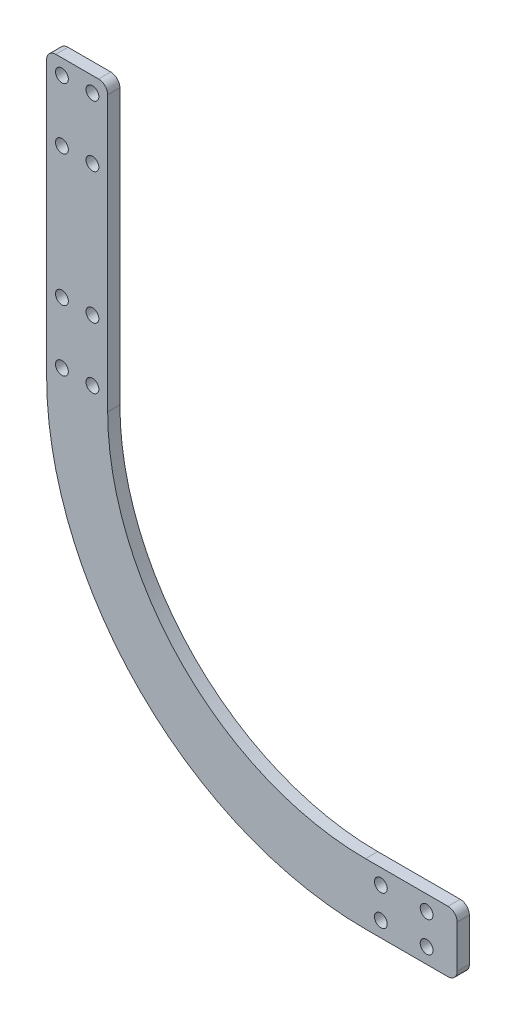
ISO-10303-21;
HEADER;
FILE_DESCRIPTION(('STEP AP214'),'2;1');
FILE_NAME('part.step','',(''),(''),'','','');
FILE_SCHEMA(('AUTOMOTIVE_DESIGN { 1 0 10303 214 1 1 1 1 }'));
ENDSEC;
DATA;
#1=APPLICATION_CONTEXT('core data for automotive mechanical design processes');
#2=APPLICATION_PROTOCOL_DEFINITION('international standard','automotive_design',2000,#1);
#3=PRODUCT_CONTEXT('',#1,'mechanical');
#4=PRODUCT('Part','Part','',(#3));
#5=PRODUCT_RELATED_PRODUCT_CATEGORY('part','',(#4));
#6=PRODUCT_DEFINITION_FORMATION('','',#4);
#7=PRODUCT_DEFINITION_CONTEXT('part definition',#1,'design');
#8=PRODUCT_DEFINITION('design','',#6,#7);
#9=PRODUCT_DEFINITION_SHAPE('','',#8);
#10=(LENGTH_UNIT() NAMED_UNIT(*) SI_UNIT(.MILLI.,.METRE.));
#11=(NAMED_UNIT(*) PLANE_ANGLE_UNIT() SI_UNIT($,.RADIAN.));
#12=(NAMED_UNIT(*) SI_UNIT($,.STERADIAN.) SOLID_ANGLE_UNIT());
#13=UNCERTAINTY_MEASURE_WITH_UNIT(LENGTH_MEASURE(1.E-05),#10,'distance_accuracy_value','');
#14=(GEOMETRIC_REPRESENTATION_CONTEXT(3) GLOBAL_UNCERTAINTY_ASSIGNED_CONTEXT((#13)) GLOBAL_UNIT_ASSIGNED_CONTEXT((#10,
#11,#12)) REPRESENTATION_CONTEXT('',''));
#15=CARTESIAN_POINT('',(0.,0.,0.));
#16=DIRECTION('',(0.,0.,1.));
#17=DIRECTION('',(1.,0.,0.));
#18=AXIS2_PLACEMENT_3D('',#15,#16,#17);
#19=CARTESIAN_POINT('',(0.,84.5,4.));
#20=DIRECTION('',(0.,0.,-1.));
#21=DIRECTION('',(-1.,0.,0.));
#22=AXIS2_PLACEMENT_3D('',#19,#20,#21);
#23=CYLINDRICAL_SURFACE('',#22,84.5);
#24=CARTESIAN_POINT('',(0.,84.5,0.));
#25=DIRECTION('',(0.,0.,-1.));
#26=DIRECTION('',(1.,0.,0.));
#27=AXIS2_PLACEMENT_3D('',#24,#25,#26);
#28=CIRCLE('',#27,84.5);
#29=CARTESIAN_POINT('',(0.,0.,0.));
#30=VERTEX_POINT('',#29);
#31=CARTESIAN_POINT('',(-84.5,84.5,0.));
#32=VERTEX_POINT('',#31);
#33=EDGE_CURVE('E144',#30,#32,#28,.T.);
#34=ORIENTED_EDGE('',*,*,#33,.T.);
#35=DIRECTION('',(0.,0.,-1.));
#36=VECTOR('',#35,1.);
#37=CARTESIAN_POINT('',(-84.5,84.5,4.));
#38=LINE('',#37,#36);
#39=CARTESIAN_POINT('',(-84.5,84.5,4.));
#40=VERTEX_POINT('',#39);
#41=EDGE_CURVE('E151',#40,#32,#38,.T.);
#42=ORIENTED_EDGE('',*,*,#41,.F.);
#43=CARTESIAN_POINT('',(0.,84.5,4.));
#44=DIRECTION('',(0.,0.,-1.));
#45=DIRECTION('',(1.,0.,0.));
#46=AXIS2_PLACEMENT_3D('',#43,#44,#45);
#47=CIRCLE('',#46,84.5);
#48=CARTESIAN_POINT('',(0.,0.,4.));
#49=VERTEX_POINT('',#48);
#50=EDGE_CURVE('E143',#49,#40,#47,.T.);
#51=ORIENTED_EDGE('',*,*,#50,.F.);
#52=DIRECTION('',(0.,0.,-1.));
#53=VECTOR('',#52,1.);
#54=CARTESIAN_POINT('',(0.,0.,4.));
#55=LINE('',#54,#53);
#56=EDGE_CURVE('E149',#49,#30,#55,.T.);
#57=ORIENTED_EDGE('',*,*,#56,.T.);
#58=EDGE_LOOP('',(#34,#42,#51,#57));
#59=FACE_BOUND('',#58,.T.);
#60=ADVANCED_FACE('F34',(#59),#23,.F.);
#61=CARTESIAN_POINT('',(0.,84.5,4.));
#62=DIRECTION('',(0.,0.,-1.));
#63=DIRECTION('',(-1.,0.,0.));
#64=AXIS2_PLACEMENT_3D('',#61,#62,#63);
#65=CYLINDRICAL_SURFACE('',#64,104.5);
#66=CARTESIAN_POINT('',(0.,84.5,0.));
#67=DIRECTION('',(0.,0.,1.));
#68=DIRECTION('',(-1.,0.,0.));
#69=AXIS2_PLACEMENT_3D('',#66,#67,#68);
#70=CIRCLE('',#69,104.5);
#71=CARTESIAN_POINT('',(-104.5,84.5,0.));
#72=VERTEX_POINT('',#71);
#73=CARTESIAN_POINT('',(0.,-20.,0.));
#74=VERTEX_POINT('',#73);
#75=EDGE_CURVE('E128',#72,#74,#70,.T.);
#76=ORIENTED_EDGE('',*,*,#75,.T.);
#77=DIRECTION('',(0.,0.,-1.));
#78=VECTOR('',#77,1.);
#79=CARTESIAN_POINT('',(0.,-20.,4.));
#80=LINE('',#79,#78);
#81=CARTESIAN_POINT('',(0.,-20.,4.));
#82=VERTEX_POINT('',#81);
#83=EDGE_CURVE('E139',#82,#74,#80,.T.);
#84=ORIENTED_EDGE('',*,*,#83,.F.);
#85=CARTESIAN_POINT('',(0.,84.5,4.));
#86=DIRECTION('',(0.,0.,1.));
#87=DIRECTION('',(-1.,0.,0.));
#88=AXIS2_PLACEMENT_3D('',#85,#86,#87);
#89=CIRCLE('',#88,104.5);
#90=CARTESIAN_POINT('',(-104.5,84.5,4.));
#91=VERTEX_POINT('',#90);
#92=EDGE_CURVE('E153',#91,#82,#89,.T.);
#93=ORIENTED_EDGE('',*,*,#92,.F.);
#94=DIRECTION('',(0.,0.,-1.));
#95=VECTOR('',#94,1.);
#96=CARTESIAN_POINT('',(-104.5,84.5,4.));
#97=LINE('',#96,#95);
#98=EDGE_CURVE('E142',#91,#72,#97,.T.);
#99=ORIENTED_EDGE('',*,*,#98,.T.);
#100=EDGE_LOOP('',(#76,#84,#93,#99));
#101=FACE_BOUND('',#100,.T.);
#102=ADVANCED_FACE('F137',(#101),#65,.T.);
#103=CARTESIAN_POINT('',(0.,84.5,4.));
#104=DIRECTION('',(0.,0.,1.));
#105=DIRECTION('',(1.,0.,0.));
#106=AXIS2_PLACEMENT_3D('',#103,#104,#105);
#107=PLANE('',#106);
#108=CARTESIAN_POINT('',(19.9999999999973,-5.00000000000145,4.));
#109=DIRECTION('',(0.,0.,1.));
#110=DIRECTION('',(1.,0.,0.));
#111=AXIS2_PLACEMENT_3D('',#108,#109,#110);
#112=CIRCLE('',#111,2.09999999999999);
#113=CARTESIAN_POINT('',(22.0999999999973,-5.00000000000145,4.));
#114=VERTEX_POINT('',#113);
#115=EDGE_CURVE('E279',#114,#114,#112,.T.);
#116=ORIENTED_EDGE('',*,*,#115,.F.);
#117=EDGE_LOOP('',(#116));
#118=FACE_BOUND('',#117,.T.);
#119=CARTESIAN_POINT('',(4.99999999999726,-5.00000000000151,4.));
#120=DIRECTION('',(0.,0.,1.));
#121=DIRECTION('',(1.,0.,0.));
#122=AXIS2_PLACEMENT_3D('',#119,#120,#121);
#123=CIRCLE('',#122,2.09999999999999);
#124=CARTESIAN_POINT('',(7.09999999999725,-5.00000000000151,4.));
#125=VERTEX_POINT('',#124);
#126=EDGE_CURVE('E272',#125,#125,#123,.T.);
#127=ORIENTED_EDGE('',*,*,#126,.F.);
#128=EDGE_LOOP('',(#127));
#129=FACE_BOUND('',#128,.T.);
#130=CARTESIAN_POINT('',(4.99999999999726,-14.9999999999985,4.));
#131=DIRECTION('',(0.,0.,1.));
#132=DIRECTION('',(1.,0.,0.));
#133=AXIS2_PLACEMENT_3D('',#130,#131,#132);
#134=CIRCLE('',#133,2.09999999999999);
#135=CARTESIAN_POINT('',(7.09999999999725,-14.9999999999985,4.));
#136=VERTEX_POINT('',#135);
#137=EDGE_CURVE('E291',#136,#136,#134,.T.);
#138=ORIENTED_EDGE('',*,*,#137,.F.);
#139=EDGE_LOOP('',(#138));
#140=FACE_BOUND('',#139,.T.);
#141=CARTESIAN_POINT('',(-99.5,109.499999999997,4.));
#142=DIRECTION('',(0.,0.,1.));
#143=DIRECTION('',(1.,0.,0.));
#144=AXIS2_PLACEMENT_3D('',#141,#142,#143);
#145=CIRCLE('',#144,2.09999999999999);
#146=CARTESIAN_POINT('',(-97.4,109.499999999997,4.));
#147=VERTEX_POINT('',#146);
#148=EDGE_CURVE('E284',#147,#147,#145,.T.);
#149=ORIENTED_EDGE('',*,*,#148,.F.);
#150=EDGE_LOOP('',(#149));
#151=FACE_BOUND('',#150,.T.);
#152=CARTESIAN_POINT('',(-89.5000000000006,152.499999999997,4.));
#153=DIRECTION('',(0.,0.,1.));
#154=DIRECTION('',(1.,0.,0.));
#155=AXIS2_PLACEMENT_3D('',#152,#153,#154);
#156=CIRCLE('',#155,2.10000000000137);
#157=CARTESIAN_POINT('',(-87.3999999999992,152.499999999997,4.));
#158=VERTEX_POINT('',#157);
#159=EDGE_CURVE('E255',#158,#158,#156,.T.);
#160=ORIENTED_EDGE('',*,*,#159,.F.);
#161=EDGE_LOOP('',(#160));
#162=FACE_BOUND('',#161,.T.);
#163=CARTESIAN_POINT('',(-89.4999999999994,172.499999999998,4.));
#164=DIRECTION('',(0.,0.,1.));
#165=DIRECTION('',(1.,0.,0.));
#166=AXIS2_PLACEMENT_3D('',#163,#164,#165);
#167=CIRCLE('',#166,2.09999999999966);
#168=CARTESIAN_POINT('',(-87.3999999999997,172.499999999998,4.));
#169=VERTEX_POINT('',#168);
#170=EDGE_CURVE('E248',#169,#169,#167,.T.);
#171=ORIENTED_EDGE('',*,*,#170,.F.);
#172=EDGE_LOOP('',(#171));
#173=FACE_BOUND('',#172,.T.);
#174=CARTESIAN_POINT('',(-99.4999999999994,172.499999999997,4.));
#175=DIRECTION('',(0.,0.,1.));
#176=DIRECTION('',(1.,0.,0.));
#177=AXIS2_PLACEMENT_3D('',#174,#175,#176);
#178=CIRCLE('',#177,2.09999999999999);
#179=CARTESIAN_POINT('',(-97.3999999999994,172.499999999997,4.));
#180=VERTEX_POINT('',#179);
#181=EDGE_CURVE('E267',#180,#180,#178,.T.);
#182=ORIENTED_EDGE('',*,*,#181,.F.);
#183=EDGE_LOOP('',(#182));
#184=FACE_BOUND('',#183,.T.);
#185=CARTESIAN_POINT('',(19.9999999999973,-14.9999999999985,4.));
#186=DIRECTION('',(0.,0.,1.));
#187=DIRECTION('',(1.,0.,0.));
#188=AXIS2_PLACEMENT_3D('',#185,#186,#187);
#189=CIRCLE('',#188,2.09999999999999);
#190=CARTESIAN_POINT('',(22.0999999999973,-14.9999999999985,4.));
#191=VERTEX_POINT('',#190);
#192=EDGE_CURVE('E260',#191,#191,#189,.T.);
#193=ORIENTED_EDGE('',*,*,#192,.F.);
#194=EDGE_LOOP('',(#193));
#195=FACE_BOUND('',#194,.T.);
#196=CARTESIAN_POINT('',(-89.5,109.499999999997,4.));
#197=DIRECTION('',(0.,0.,1.));
#198=DIRECTION('',(-1.,0.,0.));
#199=AXIS2_PLACEMENT_3D('',#196,#197,#198);
#200=CIRCLE('',#199,2.1);
#201=CARTESIAN_POINT('',(-91.6,109.499999999997,4.));
#202=VERTEX_POINT('',#201);
#203=EDGE_CURVE('E308',#202,#202,#200,.T.);
#204=ORIENTED_EDGE('',*,*,#203,.F.);
#205=EDGE_LOOP('',(#204));
#206=FACE_BOUND('',#205,.T.);
#207=CARTESIAN_POINT('',(-89.5,89.4999999999972,4.));
#208=DIRECTION('',(0.,0.,1.));
#209=DIRECTION('',(1.,0.,0.));
#210=AXIS2_PLACEMENT_3D('',#207,#208,#209);
#211=CIRCLE('',#210,2.1);
#212=CARTESIAN_POINT('',(-87.4,89.4999999999972,4.));
#213=VERTEX_POINT('',#212);
#214=EDGE_CURVE('E302',#213,#213,#211,.T.);
#215=ORIENTED_EDGE('',*,*,#214,.F.);
#216=EDGE_LOOP('',(#215));
#217=FACE_BOUND('',#216,.T.);
#218=CARTESIAN_POINT('',(-99.5,89.4999999999972,4.));
#219=DIRECTION('',(0.,0.,1.));
#220=DIRECTION('',(-1.,0.,0.));
#221=AXIS2_PLACEMENT_3D('',#218,#219,#220);
#222=CIRCLE('',#221,2.09999999999997);
#223=CARTESIAN_POINT('',(-101.6,89.4999999999972,4.));
#224=VERTEX_POINT('',#223);
#225=EDGE_CURVE('E296',#224,#224,#222,.T.);
#226=ORIENTED_EDGE('',*,*,#225,.F.);
#227=EDGE_LOOP('',(#226));
#228=FACE_BOUND('',#227,.T.);
#229=CARTESIAN_POINT('',(-99.4999999999994,152.499999999997,4.));
#230=DIRECTION('',(0.,0.,1.));
#231=DIRECTION('',(1.,0.,0.));
#232=AXIS2_PLACEMENT_3D('',#229,#230,#231);
#233=CIRCLE('',#232,2.10000000000017);
#234=CARTESIAN_POINT('',(-97.3999999999992,152.499999999997,4.));
#235=VERTEX_POINT('',#234);
#236=EDGE_CURVE('E241',#235,#235,#233,.T.);
#237=ORIENTED_EDGE('',*,*,#236,.F.);
#238=EDGE_LOOP('',(#237));
#239=FACE_BOUND('',#238,.T.);
#240=DIRECTION('',(0.,1.,0.));
#241=VECTOR('',#240,1.);
#242=CARTESIAN_POINT('',(-84.5,84.5,4.));
#243=LINE('',#242,#241);
#244=CARTESIAN_POINT('',(-84.5,174.5,4.));
#245=VERTEX_POINT('',#244);
#246=EDGE_CURVE('E224',#40,#245,#243,.T.);
#247=ORIENTED_EDGE('',*,*,#246,.T.);
#248=CARTESIAN_POINT('',(-87.5,174.5,4.));
#249=DIRECTION('',(0.,0.,1.));
#250=DIRECTION('',(1.,0.,0.));
#251=AXIS2_PLACEMENT_3D('',#248,#249,#250);
#252=CIRCLE('',#251,3.);
#253=CARTESIAN_POINT('',(-87.5,177.5,4.));
#254=VERTEX_POINT('',#253);
#255=EDGE_CURVE('E167',#245,#254,#252,.T.);
#256=ORIENTED_EDGE('',*,*,#255,.T.);
#257=DIRECTION('',(-1.,0.,0.));
#258=VECTOR('',#257,1.);
#259=CARTESIAN_POINT('',(-104.5,177.5,4.));
#260=LINE('',#259,#258);
#261=CARTESIAN_POINT('',(-101.5,177.5,4.));
#262=VERTEX_POINT('',#261);
#263=EDGE_CURVE('E219',#254,#262,#260,.T.);
#264=ORIENTED_EDGE('',*,*,#263,.T.);
#265=CARTESIAN_POINT('',(-101.5,174.5,4.));
#266=DIRECTION('',(0.,0.,1.));
#267=DIRECTION('',(1.,0.,0.));
#268=AXIS2_PLACEMENT_3D('',#265,#266,#267);
#269=CIRCLE('',#268,3.);
#270=CARTESIAN_POINT('',(-104.5,174.5,4.));
#271=VERTEX_POINT('',#270);
#272=EDGE_CURVE('E165',#262,#271,#269,.T.);
#273=ORIENTED_EDGE('',*,*,#272,.T.);
#274=DIRECTION('',(0.,-1.,0.));
#275=VECTOR('',#274,1.);
#276=CARTESIAN_POINT('',(-104.5,84.5,4.));
#277=LINE('',#276,#275);
#278=EDGE_CURVE('E200',#271,#91,#277,.T.);
#279=ORIENTED_EDGE('',*,*,#278,.T.);
#280=ORIENTED_EDGE('',*,*,#92,.T.);
#281=DIRECTION('',(1.,0.,0.));
#282=VECTOR('',#281,1.);
#283=CARTESIAN_POINT('',(0.,-20.,4.));
#284=LINE('',#283,#282);
#285=CARTESIAN_POINT('',(27.,-20.,4.));
#286=VERTEX_POINT('',#285);
#287=EDGE_CURVE('E148',#82,#286,#284,.T.);
#288=ORIENTED_EDGE('',*,*,#287,.T.);
#289=CARTESIAN_POINT('',(27.,-17.,4.));
#290=DIRECTION('',(0.,0.,1.));
#291=DIRECTION('',(1.,0.,0.));
#292=AXIS2_PLACEMENT_3D('',#289,#290,#291);
#293=CIRCLE('',#292,3.);
#294=CARTESIAN_POINT('',(30.,-17.,4.));
#295=VERTEX_POINT('',#294);
#296=EDGE_CURVE('E161',#286,#295,#293,.T.);
#297=ORIENTED_EDGE('',*,*,#296,.T.);
#298=DIRECTION('',(0.,1.,0.));
#299=VECTOR('',#298,1.);
#300=CARTESIAN_POINT('',(30.,0.,4.));
#301=LINE('',#300,#299);
#302=CARTESIAN_POINT('',(30.,-3.,4.));
#303=VERTEX_POINT('',#302);
#304=EDGE_CURVE('E133',#295,#303,#301,.T.);
#305=ORIENTED_EDGE('',*,*,#304,.T.);
#306=CARTESIAN_POINT('',(27.,-3.,4.));
#307=DIRECTION('',(0.,0.,1.));
#308=DIRECTION('',(1.,0.,0.));
#309=AXIS2_PLACEMENT_3D('',#306,#307,#308);
#310=CIRCLE('',#309,3.);
#311=CARTESIAN_POINT('',(27.,0.,4.));
#312=VERTEX_POINT('',#311);
#313=EDGE_CURVE('E163',#303,#312,#310,.T.);
#314=ORIENTED_EDGE('',*,*,#313,.T.);
#315=DIRECTION('',(-1.,0.,0.));
#316=VECTOR('',#315,1.);
#317=CARTESIAN_POINT('',(0.,0.,4.));
#318=LINE('',#317,#316);
#319=EDGE_CURVE('E194',#312,#49,#318,.T.);
#320=ORIENTED_EDGE('',*,*,#319,.T.);
#321=ORIENTED_EDGE('',*,*,#50,.T.);
#322=EDGE_LOOP('',(#247,#256,#264,#273,#279,#280,#288,#297,#305,#314,#320,#321));
#323=FACE_BOUND('',#322,.T.);
#324=ADVANCED_FACE('F211',(#118,#129,#140,#151,#162,#173,#184,#195,#206,#217,#228,#239,#323),
#107,.T.);
#325=CARTESIAN_POINT('',(0.,84.5,0.));
#326=DIRECTION('',(0.,0.,1.));
#327=DIRECTION('',(1.,0.,0.));
#328=AXIS2_PLACEMENT_3D('',#325,#326,#327);
#329=PLANE('',#328);
#330=CARTESIAN_POINT('',(19.9999999999973,-5.00000000000145,0.));
#331=DIRECTION('',(0.,0.,1.));
#332=DIRECTION('',(1.,0.,0.));
#333=AXIS2_PLACEMENT_3D('',#330,#331,#332);
#334=CIRCLE('',#333,2.09999999999999);
#335=CARTESIAN_POINT('',(22.0999999999973,-5.00000000000145,0.));
#336=VERTEX_POINT('',#335);
#337=EDGE_CURVE('E264',#336,#336,#334,.T.);
#338=ORIENTED_EDGE('',*,*,#337,.T.);
#339=EDGE_LOOP('',(#338));
#340=FACE_BOUND('',#339,.T.);
#341=CARTESIAN_POINT('',(4.99999999999726,-5.00000000000151,0.));
#342=DIRECTION('',(0.,0.,1.));
#343=DIRECTION('',(1.,0.,0.));
#344=AXIS2_PLACEMENT_3D('',#341,#342,#343);
#345=CIRCLE('',#344,2.09999999999999);
#346=CARTESIAN_POINT('',(7.09999999999725,-5.00000000000151,0.));
#347=VERTEX_POINT('',#346);
#348=EDGE_CURVE('E275',#347,#347,#345,.T.);
#349=ORIENTED_EDGE('',*,*,#348,.T.);
#350=EDGE_LOOP('',(#349));
#351=FACE_BOUND('',#350,.T.);
#352=CARTESIAN_POINT('',(4.99999999999726,-14.9999999999985,0.));
#353=DIRECTION('',(0.,0.,1.));
#354=DIRECTION('',(1.,0.,0.));
#355=AXIS2_PLACEMENT_3D('',#352,#353,#354);
#356=CIRCLE('',#355,2.09999999999999);
#357=CARTESIAN_POINT('',(7.09999999999725,-14.9999999999985,0.));
#358=VERTEX_POINT('',#357);
#359=EDGE_CURVE('E276',#358,#358,#356,.T.);
#360=ORIENTED_EDGE('',*,*,#359,.T.);
#361=EDGE_LOOP('',(#360));
#362=FACE_BOUND('',#361,.T.);
#363=CARTESIAN_POINT('',(-99.5,109.499999999997,0.));
#364=DIRECTION('',(0.,0.,1.));
#365=DIRECTION('',(1.,0.,0.));
#366=AXIS2_PLACEMENT_3D('',#363,#364,#365);
#367=CIRCLE('',#366,2.09999999999999);
#368=CARTESIAN_POINT('',(-97.4,109.499999999997,0.));
#369=VERTEX_POINT('',#368);
#370=EDGE_CURVE('E287',#369,#369,#367,.T.);
#371=ORIENTED_EDGE('',*,*,#370,.T.);
#372=EDGE_LOOP('',(#371));
#373=FACE_BOUND('',#372,.T.);
#374=CARTESIAN_POINT('',(-89.5000000000006,152.499999999997,0.));
#375=DIRECTION('',(0.,0.,1.));
#376=DIRECTION('',(1.,0.,0.));
#377=AXIS2_PLACEMENT_3D('',#374,#375,#376);
#378=CIRCLE('',#377,2.10000000000137);
#379=CARTESIAN_POINT('',(-87.3999999999992,152.499999999997,0.));
#380=VERTEX_POINT('',#379);
#381=EDGE_CURVE('E246',#380,#380,#378,.T.);
#382=ORIENTED_EDGE('',*,*,#381,.T.);
#383=EDGE_LOOP('',(#382));
#384=FACE_BOUND('',#383,.T.);
#385=CARTESIAN_POINT('',(-89.4999999999994,172.499999999998,0.));
#386=DIRECTION('',(0.,0.,1.));
#387=DIRECTION('',(1.,0.,0.));
#388=AXIS2_PLACEMENT_3D('',#385,#386,#387);
#389=CIRCLE('',#388,2.09999999999966);
#390=CARTESIAN_POINT('',(-87.3999999999997,172.499999999998,0.));
#391=VERTEX_POINT('',#390);
#392=EDGE_CURVE('E251',#391,#391,#389,.T.);
#393=ORIENTED_EDGE('',*,*,#392,.T.);
#394=EDGE_LOOP('',(#393));
#395=FACE_BOUND('',#394,.T.);
#396=CARTESIAN_POINT('',(-99.4999999999994,172.499999999997,0.));
#397=DIRECTION('',(0.,0.,1.));
#398=DIRECTION('',(1.,0.,0.));
#399=AXIS2_PLACEMENT_3D('',#396,#397,#398);
#400=CIRCLE('',#399,2.09999999999999);
#401=CARTESIAN_POINT('',(-97.3999999999994,172.499999999997,0.));
#402=VERTEX_POINT('',#401);
#403=EDGE_CURVE('E252',#402,#402,#400,.T.);
#404=ORIENTED_EDGE('',*,*,#403,.T.);
#405=EDGE_LOOP('',(#404));
#406=FACE_BOUND('',#405,.T.);
#407=CARTESIAN_POINT('',(19.9999999999973,-14.9999999999985,0.));
#408=DIRECTION('',(0.,0.,1.));
#409=DIRECTION('',(1.,0.,0.));
#410=AXIS2_PLACEMENT_3D('',#407,#408,#409);
#411=CIRCLE('',#410,2.09999999999999);
#412=CARTESIAN_POINT('',(22.0999999999973,-14.9999999999985,0.));
#413=VERTEX_POINT('',#412);
#414=EDGE_CURVE('E263',#413,#413,#411,.T.);
#415=ORIENTED_EDGE('',*,*,#414,.T.);
#416=EDGE_LOOP('',(#415));
#417=FACE_BOUND('',#416,.T.);
#418=CARTESIAN_POINT('',(-89.5,109.499999999997,0.));
#419=DIRECTION('',(0.,0.,1.));
#420=DIRECTION('',(-1.,0.,0.));
#421=AXIS2_PLACEMENT_3D('',#418,#419,#420);
#422=CIRCLE('',#421,2.1);
#423=CARTESIAN_POINT('',(-91.6,109.499999999997,0.));
#424=VERTEX_POINT('',#423);
#425=EDGE_CURVE('E288',#424,#424,#422,.T.);
#426=ORIENTED_EDGE('',*,*,#425,.T.);
#427=EDGE_LOOP('',(#426));
#428=FACE_BOUND('',#427,.T.);
#429=CARTESIAN_POINT('',(-89.5,89.4999999999972,0.));
#430=DIRECTION('',(0.,0.,1.));
#431=DIRECTION('',(1.,0.,0.));
#432=AXIS2_PLACEMENT_3D('',#429,#430,#431);
#433=CIRCLE('',#432,2.1);
#434=CARTESIAN_POINT('',(-87.4,89.4999999999972,0.));
#435=VERTEX_POINT('',#434);
#436=EDGE_CURVE('E305',#435,#435,#433,.T.);
#437=ORIENTED_EDGE('',*,*,#436,.T.);
#438=EDGE_LOOP('',(#437));
#439=FACE_BOUND('',#438,.T.);
#440=CARTESIAN_POINT('',(-99.5,89.4999999999972,0.));
#441=DIRECTION('',(0.,0.,1.));
#442=DIRECTION('',(-1.,0.,0.));
#443=AXIS2_PLACEMENT_3D('',#440,#441,#442);
#444=CIRCLE('',#443,2.09999999999997);
#445=CARTESIAN_POINT('',(-101.6,89.4999999999972,0.));
#446=VERTEX_POINT('',#445);
#447=EDGE_CURVE('E299',#446,#446,#444,.T.);
#448=ORIENTED_EDGE('',*,*,#447,.T.);
#449=EDGE_LOOP('',(#448));
#450=FACE_BOUND('',#449,.T.);
#451=CARTESIAN_POINT('',(-99.4999999999994,152.499999999997,0.));
#452=DIRECTION('',(0.,0.,1.));
#453=DIRECTION('',(1.,0.,0.));
#454=AXIS2_PLACEMENT_3D('',#451,#452,#453);
#455=CIRCLE('',#454,2.10000000000017);
#456=CARTESIAN_POINT('',(-97.3999999999992,152.499999999997,0.));
#457=VERTEX_POINT('',#456);
#458=EDGE_CURVE('E239',#457,#457,#455,.T.);
#459=ORIENTED_EDGE('',*,*,#458,.T.);
#460=EDGE_LOOP('',(#459));
#461=FACE_BOUND('',#460,.T.);
#462=DIRECTION('',(1.,0.,0.));
#463=VECTOR('',#462,1.);
#464=CARTESIAN_POINT('',(-104.5,177.5,0.));
#465=LINE('',#464,#463);
#466=CARTESIAN_POINT('',(-101.5,177.5,0.));
#467=VERTEX_POINT('',#466);
#468=CARTESIAN_POINT('',(-87.5,177.5,0.));
#469=VERTEX_POINT('',#468);
#470=EDGE_CURVE('E218',#467,#469,#465,.T.);
#471=ORIENTED_EDGE('',*,*,#470,.T.);
#472=CARTESIAN_POINT('',(-87.5,174.5,0.));
#473=DIRECTION('',(0.,0.,1.));
#474=DIRECTION('',(1.,0.,0.));
#475=AXIS2_PLACEMENT_3D('',#472,#473,#474);
#476=CIRCLE('',#475,3.);
#477=CARTESIAN_POINT('',(-84.5,174.5,0.));
#478=VERTEX_POINT('',#477);
#479=EDGE_CURVE('E179',#469,#478,#476,.F.);
#480=ORIENTED_EDGE('',*,*,#479,.T.);
#481=DIRECTION('',(0.,-1.,0.));
#482=VECTOR('',#481,1.);
#483=CARTESIAN_POINT('',(-84.5,84.5,0.));
#484=LINE('',#483,#482);
#485=EDGE_CURVE('E216',#478,#32,#484,.T.);
#486=ORIENTED_EDGE('',*,*,#485,.T.);
#487=ORIENTED_EDGE('',*,*,#33,.F.);
#488=DIRECTION('',(1.,0.,0.));
#489=VECTOR('',#488,1.);
#490=CARTESIAN_POINT('',(0.,0.,0.));
#491=LINE('',#490,#489);
#492=CARTESIAN_POINT('',(27.,0.,0.));
#493=VERTEX_POINT('',#492);
#494=EDGE_CURVE('E193',#30,#493,#491,.T.);
#495=ORIENTED_EDGE('',*,*,#494,.T.);
#496=CARTESIAN_POINT('',(27.,-3.,0.));
#497=DIRECTION('',(0.,0.,1.));
#498=DIRECTION('',(1.,0.,0.));
#499=AXIS2_PLACEMENT_3D('',#496,#497,#498);
#500=CIRCLE('',#499,3.);
#501=CARTESIAN_POINT('',(30.,-3.,0.));
#502=VERTEX_POINT('',#501);
#503=EDGE_CURVE('E175',#493,#502,#500,.F.);
#504=ORIENTED_EDGE('',*,*,#503,.T.);
#505=DIRECTION('',(0.,-1.,0.));
#506=VECTOR('',#505,1.);
#507=CARTESIAN_POINT('',(30.,0.,0.));
#508=LINE('',#507,#506);
#509=CARTESIAN_POINT('',(30.,-17.,0.));
#510=VERTEX_POINT('',#509);
#511=EDGE_CURVE('E132',#502,#510,#508,.T.);
#512=ORIENTED_EDGE('',*,*,#511,.T.);
#513=CARTESIAN_POINT('',(27.,-17.,0.));
#514=DIRECTION('',(0.,0.,1.));
#515=DIRECTION('',(1.,0.,0.));
#516=AXIS2_PLACEMENT_3D('',#513,#514,#515);
#517=CIRCLE('',#516,3.);
#518=CARTESIAN_POINT('',(27.,-20.,0.));
#519=VERTEX_POINT('',#518);
#520=EDGE_CURVE('E57',#510,#519,#517,.F.);
#521=ORIENTED_EDGE('',*,*,#520,.T.);
#522=DIRECTION('',(-1.,0.,0.));
#523=VECTOR('',#522,1.);
#524=CARTESIAN_POINT('',(0.,-20.,0.));
#525=LINE('',#524,#523);
#526=EDGE_CURVE('E124',#519,#74,#525,.T.);
#527=ORIENTED_EDGE('',*,*,#526,.T.);
#528=ORIENTED_EDGE('',*,*,#75,.F.);
#529=DIRECTION('',(0.,1.,0.));
#530=VECTOR('',#529,1.);
#531=CARTESIAN_POINT('',(-104.5,84.5,0.));
#532=LINE('',#531,#530);
#533=CARTESIAN_POINT('',(-104.5,174.5,0.));
#534=VERTEX_POINT('',#533);
#535=EDGE_CURVE('E221',#72,#534,#532,.T.);
#536=ORIENTED_EDGE('',*,*,#535,.T.);
#537=CARTESIAN_POINT('',(-101.5,174.5,0.));
#538=DIRECTION('',(0.,0.,1.));
#539=DIRECTION('',(1.,0.,0.));
#540=AXIS2_PLACEMENT_3D('',#537,#538,#539);
#541=CIRCLE('',#540,3.);
#542=EDGE_CURVE('E177',#534,#467,#541,.F.);
#543=ORIENTED_EDGE('',*,*,#542,.T.);
#544=EDGE_LOOP('',(#471,#480,#486,#487,#495,#504,#512,#521,#527,#528,#536,#543));
#545=FACE_BOUND('',#544,.T.);
#546=ADVANCED_FACE('F127',(#340,#351,#362,#373,#384,#395,#406,#417,#428,#439,#450,#461,#545),
#329,.F.);
#547=CARTESIAN_POINT('',(-104.5,84.5,-95.1262319236918));
#548=DIRECTION('',(-1.,0.,0.));
#549=DIRECTION('',(0.,0.,1.));
#550=AXIS2_PLACEMENT_3D('',#547,#548,#549);
#551=PLANE('',#550);
#552=ORIENTED_EDGE('',*,*,#278,.F.);
#553=DIRECTION('',(0.,0.,1.));
#554=VECTOR('',#553,1.);
#555=CARTESIAN_POINT('',(-104.5,174.5,-95.1262319236918));
#556=LINE('',#555,#554);
#557=EDGE_CURVE('E49',#271,#534,#556,.F.);
#558=ORIENTED_EDGE('',*,*,#557,.T.);
#559=ORIENTED_EDGE('',*,*,#535,.F.);
#560=ORIENTED_EDGE('',*,*,#98,.F.);
#561=EDGE_LOOP('',(#552,#558,#559,#560));
#562=FACE_BOUND('',#561,.T.);
#563=ADVANCED_FACE('F372',(#562),#551,.T.);
#564=CARTESIAN_POINT('',(-104.5,177.5,-95.1262319236918));
#565=DIRECTION('',(0.,1.,0.));
#566=DIRECTION('',(0.,0.,1.));
#567=AXIS2_PLACEMENT_3D('',#564,#565,#566);
#568=PLANE('',#567);
#569=ORIENTED_EDGE('',*,*,#263,.F.);
#570=DIRECTION('',(0.,0.,1.));
#571=VECTOR('',#570,1.);
#572=CARTESIAN_POINT('',(-87.5,177.5,-95.1262319236918));
#573=LINE('',#572,#571);
#574=EDGE_CURVE('E172',#254,#469,#573,.F.);
#575=ORIENTED_EDGE('',*,*,#574,.T.);
#576=ORIENTED_EDGE('',*,*,#470,.F.);
#577=DIRECTION('',(0.,0.,1.));
#578=VECTOR('',#577,1.);
#579=CARTESIAN_POINT('',(-101.5,177.5,-95.1262319236918));
#580=LINE('',#579,#578);
#581=EDGE_CURVE('E169',#467,#262,#580,.T.);
#582=ORIENTED_EDGE('',*,*,#581,.T.);
#583=EDGE_LOOP('',(#569,#575,#576,#582));
#584=FACE_BOUND('',#583,.T.);
#585=ADVANCED_FACE('F377',(#584),#568,.T.);
#586=CARTESIAN_POINT('',(-84.5,84.5,-95.1262319236918));
#587=DIRECTION('',(1.,0.,0.));
#588=DIRECTION('',(0.,0.,-1.));
#589=AXIS2_PLACEMENT_3D('',#586,#587,#588);
#590=PLANE('',#589);
#591=ORIENTED_EDGE('',*,*,#485,.F.);
#592=DIRECTION('',(0.,0.,1.));
#593=VECTOR('',#592,1.);
#594=CARTESIAN_POINT('',(-84.5,174.5,-95.1262319236918));
#595=LINE('',#594,#593);
#596=EDGE_CURVE('E158',#478,#245,#595,.T.);
#597=ORIENTED_EDGE('',*,*,#596,.T.);
#598=ORIENTED_EDGE('',*,*,#246,.F.);
#599=ORIENTED_EDGE('',*,*,#41,.T.);
#600=EDGE_LOOP('',(#591,#597,#598,#599));
#601=FACE_BOUND('',#600,.T.);
#602=ADVANCED_FACE('F236',(#601),#590,.T.);
#603=CARTESIAN_POINT('',(0.,0.,-36.0555127546399));
#604=DIRECTION('',(0.,1.,0.));
#605=DIRECTION('',(0.,0.,1.));
#606=AXIS2_PLACEMENT_3D('',#603,#604,#605);
#607=PLANE('',#606);
#608=ORIENTED_EDGE('',*,*,#319,.F.);
#609=DIRECTION('',(0.,0.,1.));
#610=VECTOR('',#609,1.);
#611=CARTESIAN_POINT('',(27.,0.,-36.0555127546399));
#612=LINE('',#611,#610);
#613=EDGE_CURVE('E42',#312,#493,#612,.F.);
#614=ORIENTED_EDGE('',*,*,#613,.T.);
#615=ORIENTED_EDGE('',*,*,#494,.F.);
#616=ORIENTED_EDGE('',*,*,#56,.F.);
#617=EDGE_LOOP('',(#608,#614,#615,#616));
#618=FACE_BOUND('',#617,.T.);
#619=ADVANCED_FACE('F191',(#618),#607,.T.);
#620=CARTESIAN_POINT('',(30.,0.,-36.0555127546399));
#621=DIRECTION('',(1.,0.,0.));
#622=DIRECTION('',(0.,0.,-1.));
#623=AXIS2_PLACEMENT_3D('',#620,#621,#622);
#624=PLANE('',#623);
#625=ORIENTED_EDGE('',*,*,#511,.F.);
#626=DIRECTION('',(0.,0.,1.));
#627=VECTOR('',#626,1.);
#628=CARTESIAN_POINT('',(30.,-3.,-36.0555127546399));
#629=LINE('',#628,#627);
#630=EDGE_CURVE('E184',#502,#303,#629,.T.);
#631=ORIENTED_EDGE('',*,*,#630,.T.);
#632=ORIENTED_EDGE('',*,*,#304,.F.);
#633=DIRECTION('',(0.,0.,1.));
#634=VECTOR('',#633,1.);
#635=CARTESIAN_POINT('',(30.,-17.,-36.0555127546399));
#636=LINE('',#635,#634);
#637=EDGE_CURVE('E182',#295,#510,#636,.F.);
#638=ORIENTED_EDGE('',*,*,#637,.T.);
#639=EDGE_LOOP('',(#625,#631,#632,#638));
#640=FACE_BOUND('',#639,.T.);
#641=ADVANCED_FACE('F207',(#640),#624,.T.);
#642=CARTESIAN_POINT('',(0.,-20.,-36.0555127546399));
#643=DIRECTION('',(0.,-1.,0.));
#644=DIRECTION('',(0.,0.,-1.));
#645=AXIS2_PLACEMENT_3D('',#642,#643,#644);
#646=PLANE('',#645);
#647=ORIENTED_EDGE('',*,*,#526,.F.);
#648=DIRECTION('',(0.,0.,1.));
#649=VECTOR('',#648,1.);
#650=CARTESIAN_POINT('',(27.,-20.,-36.0555127546399));
#651=LINE('',#650,#649);
#652=EDGE_CURVE('E11',#519,#286,#651,.T.);
#653=ORIENTED_EDGE('',*,*,#652,.T.);
#654=ORIENTED_EDGE('',*,*,#287,.F.);
#655=ORIENTED_EDGE('',*,*,#83,.T.);
#656=EDGE_LOOP('',(#647,#653,#654,#655));
#657=FACE_BOUND('',#656,.T.);
#658=ADVANCED_FACE('F146',(#657),#646,.T.);
#659=CARTESIAN_POINT('',(-99.4999999999994,152.499999999997,0.));
#660=DIRECTION('',(0.,0.,1.));
#661=DIRECTION('',(1.,0.,0.));
#662=AXIS2_PLACEMENT_3D('',#659,#660,#661);
#663=CYLINDRICAL_SURFACE('',#662,2.10000000000017);
#664=ORIENTED_EDGE('',*,*,#458,.F.);
#665=EDGE_LOOP('',(#664));
#666=FACE_BOUND('',#665,.T.);
#667=ORIENTED_EDGE('',*,*,#236,.T.);
#668=EDGE_LOOP('',(#667));
#669=FACE_BOUND('',#668,.T.);
#670=ADVANCED_FACE('F334',(#666,#669),#663,.F.);
#671=CARTESIAN_POINT('',(-99.5,89.4999999999972,0.));
#672=DIRECTION('',(0.,0.,1.));
#673=DIRECTION('',(1.,0.,0.));
#674=AXIS2_PLACEMENT_3D('',#671,#672,#673);
#675=CYLINDRICAL_SURFACE('',#674,2.09999999999997);
#676=ORIENTED_EDGE('',*,*,#447,.F.);
#677=EDGE_LOOP('',(#676));
#678=FACE_BOUND('',#677,.T.);
#679=ORIENTED_EDGE('',*,*,#225,.T.);
#680=EDGE_LOOP('',(#679));
#681=FACE_BOUND('',#680,.T.);
#682=ADVANCED_FACE('F336',(#678,#681),#675,.F.);
#683=CARTESIAN_POINT('',(-89.5,89.4999999999972,0.));
#684=DIRECTION('',(0.,0.,1.));
#685=DIRECTION('',(1.,0.,0.));
#686=AXIS2_PLACEMENT_3D('',#683,#684,#685);
#687=CYLINDRICAL_SURFACE('',#686,2.1);
#688=ORIENTED_EDGE('',*,*,#436,.F.);
#689=EDGE_LOOP('',(#688));
#690=FACE_BOUND('',#689,.T.);
#691=ORIENTED_EDGE('',*,*,#214,.T.);
#692=EDGE_LOOP('',(#691));
#693=FACE_BOUND('',#692,.T.);
#694=ADVANCED_FACE('F320',(#690,#693),#687,.F.);
#695=CARTESIAN_POINT('',(-89.5,109.499999999997,0.));
#696=DIRECTION('',(0.,0.,1.));
#697=DIRECTION('',(1.,0.,0.));
#698=AXIS2_PLACEMENT_3D('',#695,#696,#697);
#699=CYLINDRICAL_SURFACE('',#698,2.1);
#700=ORIENTED_EDGE('',*,*,#425,.F.);
#701=EDGE_LOOP('',(#700));
#702=FACE_BOUND('',#701,.T.);
#703=ORIENTED_EDGE('',*,*,#203,.T.);
#704=EDGE_LOOP('',(#703));
#705=FACE_BOUND('',#704,.T.);
#706=ADVANCED_FACE('F316',(#702,#705),#699,.F.);
#707=CARTESIAN_POINT('',(19.9999999999973,-14.9999999999985,0.));
#708=DIRECTION('',(0.,0.,1.));
#709=DIRECTION('',(1.,0.,0.));
#710=AXIS2_PLACEMENT_3D('',#707,#708,#709);
#711=CYLINDRICAL_SURFACE('',#710,2.09999999999999);
#712=ORIENTED_EDGE('',*,*,#414,.F.);
#713=EDGE_LOOP('',(#712));
#714=FACE_BOUND('',#713,.T.);
#715=ORIENTED_EDGE('',*,*,#192,.T.);
#716=EDGE_LOOP('',(#715));
#717=FACE_BOUND('',#716,.T.);
#718=ADVANCED_FACE('F319',(#714,#717),#711,.F.);
#719=CARTESIAN_POINT('',(-99.4999999999994,172.499999999997,0.));
#720=DIRECTION('',(0.,0.,1.));
#721=DIRECTION('',(1.,0.,0.));
#722=AXIS2_PLACEMENT_3D('',#719,#720,#721);
#723=CYLINDRICAL_SURFACE('',#722,2.09999999999999);
#724=ORIENTED_EDGE('',*,*,#403,.F.);
#725=EDGE_LOOP('',(#724));
#726=FACE_BOUND('',#725,.T.);
#727=ORIENTED_EDGE('',*,*,#181,.T.);
#728=EDGE_LOOP('',(#727));
#729=FACE_BOUND('',#728,.T.);
#730=ADVANCED_FACE('F411',(#726,#729),#723,.F.);
#731=CARTESIAN_POINT('',(-89.4999999999994,172.499999999998,0.));
#732=DIRECTION('',(0.,0.,1.));
#733=DIRECTION('',(1.,0.,0.));
#734=AXIS2_PLACEMENT_3D('',#731,#732,#733);
#735=CYLINDRICAL_SURFACE('',#734,2.09999999999966);
#736=ORIENTED_EDGE('',*,*,#392,.F.);
#737=EDGE_LOOP('',(#736));
#738=FACE_BOUND('',#737,.T.);
#739=ORIENTED_EDGE('',*,*,#170,.T.);
#740=EDGE_LOOP('',(#739));
#741=FACE_BOUND('',#740,.T.);
#742=ADVANCED_FACE('F418',(#738,#741),#735,.F.);
#743=CARTESIAN_POINT('',(-89.5000000000006,152.499999999997,0.));
#744=DIRECTION('',(0.,0.,1.));
#745=DIRECTION('',(1.,0.,0.));
#746=AXIS2_PLACEMENT_3D('',#743,#744,#745);
#747=CYLINDRICAL_SURFACE('',#746,2.10000000000137);
#748=ORIENTED_EDGE('',*,*,#381,.F.);
#749=EDGE_LOOP('',(#748));
#750=FACE_BOUND('',#749,.T.);
#751=ORIENTED_EDGE('',*,*,#159,.T.);
#752=EDGE_LOOP('',(#751));
#753=FACE_BOUND('',#752,.T.);
#754=ADVANCED_FACE('F423',(#750,#753),#747,.F.);
#755=CARTESIAN_POINT('',(-99.5,109.499999999997,0.));
#756=DIRECTION('',(0.,0.,1.));
#757=DIRECTION('',(1.,0.,0.));
#758=AXIS2_PLACEMENT_3D('',#755,#756,#757);
#759=CYLINDRICAL_SURFACE('',#758,2.09999999999999);
#760=ORIENTED_EDGE('',*,*,#370,.F.);
#761=EDGE_LOOP('',(#760));
#762=FACE_BOUND('',#761,.T.);
#763=ORIENTED_EDGE('',*,*,#148,.T.);
#764=EDGE_LOOP('',(#763));
#765=FACE_BOUND('',#764,.T.);
#766=ADVANCED_FACE('F425',(#762,#765),#759,.F.);
#767=CARTESIAN_POINT('',(4.99999999999726,-14.9999999999985,0.));
#768=DIRECTION('',(0.,0.,1.));
#769=DIRECTION('',(1.,0.,0.));
#770=AXIS2_PLACEMENT_3D('',#767,#768,#769);
#771=CYLINDRICAL_SURFACE('',#770,2.09999999999999);
#772=ORIENTED_EDGE('',*,*,#359,.F.);
#773=EDGE_LOOP('',(#772));
#774=FACE_BOUND('',#773,.T.);
#775=ORIENTED_EDGE('',*,*,#137,.T.);
#776=EDGE_LOOP('',(#775));
#777=FACE_BOUND('',#776,.T.);
#778=ADVANCED_FACE('F449',(#774,#777),#771,.F.);
#779=CARTESIAN_POINT('',(4.99999999999726,-5.00000000000151,0.));
#780=DIRECTION('',(0.,0.,1.));
#781=DIRECTION('',(1.,0.,0.));
#782=AXIS2_PLACEMENT_3D('',#779,#780,#781);
#783=CYLINDRICAL_SURFACE('',#782,2.09999999999999);
#784=ORIENTED_EDGE('',*,*,#348,.F.);
#785=EDGE_LOOP('',(#784));
#786=FACE_BOUND('',#785,.T.);
#787=ORIENTED_EDGE('',*,*,#126,.T.);
#788=EDGE_LOOP('',(#787));
#789=FACE_BOUND('',#788,.T.);
#790=ADVANCED_FACE('F457',(#786,#789),#783,.F.);
#791=CARTESIAN_POINT('',(19.9999999999973,-5.00000000000145,0.));
#792=DIRECTION('',(0.,0.,1.));
#793=DIRECTION('',(1.,0.,0.));
#794=AXIS2_PLACEMENT_3D('',#791,#792,#793);
#795=CYLINDRICAL_SURFACE('',#794,2.09999999999999);
#796=ORIENTED_EDGE('',*,*,#337,.F.);
#797=EDGE_LOOP('',(#796));
#798=FACE_BOUND('',#797,.T.);
#799=ORIENTED_EDGE('',*,*,#115,.T.);
#800=EDGE_LOOP('',(#799));
#801=FACE_BOUND('',#800,.T.);
#802=ADVANCED_FACE('F361',(#798,#801),#795,.F.);
#803=CARTESIAN_POINT('',(-87.5,174.5,-95.1262319236918));
#804=DIRECTION('',(0.,0.,1.));
#805=DIRECTION('',(1.,0.,0.));
#806=AXIS2_PLACEMENT_3D('',#803,#804,#805);
#807=CYLINDRICAL_SURFACE('',#806,3.);
#808=ORIENTED_EDGE('',*,*,#479,.F.);
#809=ORIENTED_EDGE('',*,*,#574,.F.);
#810=ORIENTED_EDGE('',*,*,#255,.F.);
#811=ORIENTED_EDGE('',*,*,#596,.F.);
#812=EDGE_LOOP('',(#808,#809,#810,#811));
#813=FACE_BOUND('',#812,.T.);
#814=ADVANCED_FACE('F357',(#813),#807,.T.);
#815=CARTESIAN_POINT('',(-101.5,174.5,-95.1262319236918));
#816=DIRECTION('',(0.,0.,1.));
#817=DIRECTION('',(1.,0.,0.));
#818=AXIS2_PLACEMENT_3D('',#815,#816,#817);
#819=CYLINDRICAL_SURFACE('',#818,3.);
#820=ORIENTED_EDGE('',*,*,#542,.F.);
#821=ORIENTED_EDGE('',*,*,#557,.F.);
#822=ORIENTED_EDGE('',*,*,#272,.F.);
#823=ORIENTED_EDGE('',*,*,#581,.F.);
#824=EDGE_LOOP('',(#820,#821,#822,#823));
#825=FACE_BOUND('',#824,.T.);
#826=ADVANCED_FACE('F360',(#825),#819,.T.);
#827=CARTESIAN_POINT('',(27.,-3.,-36.0555127546399));
#828=DIRECTION('',(0.,0.,1.));
#829=DIRECTION('',(1.,0.,0.));
#830=AXIS2_PLACEMENT_3D('',#827,#828,#829);
#831=CYLINDRICAL_SURFACE('',#830,3.);
#832=ORIENTED_EDGE('',*,*,#503,.F.);
#833=ORIENTED_EDGE('',*,*,#613,.F.);
#834=ORIENTED_EDGE('',*,*,#313,.F.);
#835=ORIENTED_EDGE('',*,*,#630,.F.);
#836=EDGE_LOOP('',(#832,#833,#834,#835));
#837=FACE_BOUND('',#836,.T.);
#838=ADVANCED_FACE('F203',(#837),#831,.T.);
#839=CARTESIAN_POINT('',(27.,-17.,-36.0555127546399));
#840=DIRECTION('',(0.,0.,1.));
#841=DIRECTION('',(1.,0.,0.));
#842=AXIS2_PLACEMENT_3D('',#839,#840,#841);
#843=CYLINDRICAL_SURFACE('',#842,3.);
#844=ORIENTED_EDGE('',*,*,#520,.F.);
#845=ORIENTED_EDGE('',*,*,#637,.F.);
#846=ORIENTED_EDGE('',*,*,#296,.F.);
#847=ORIENTED_EDGE('',*,*,#652,.F.);
#848=EDGE_LOOP('',(#844,#845,#846,#847));
#849=FACE_BOUND('',#848,.T.);
#850=ADVANCED_FACE('F36',(#849),#843,.T.);
#851=CLOSED_SHELL('',(#60,#102,#324,#546,#563,#585,#602,#619,#641,#658,#670,#682,#694,#706,#718,
#730,#742,#754,#766,#778,#790,#802,#814,#826,#838,#850));
#852=MANIFOLD_SOLID_BREP('B2',#851);
#853=ADVANCED_BREP_SHAPE_REPRESENTATION('',(#18,#852),#14);
#854=SHAPE_DEFINITION_REPRESENTATION(#9,#853);
ENDSEC;
END-ISO-10303-21;
